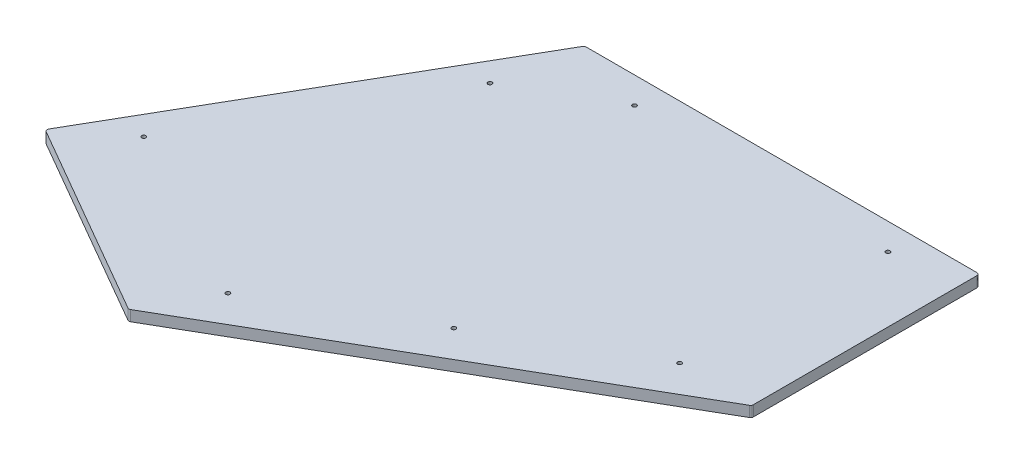
ISO-10303-21;
HEADER;
FILE_DESCRIPTION(('STEP AP214'),'2;1');
FILE_NAME('part.step','',(''),(''),'','','');
FILE_SCHEMA(('AUTOMOTIVE_DESIGN { 1 0 10303 214 1 1 1 1 }'));
ENDSEC;
DATA;
#1=APPLICATION_CONTEXT('core data for automotive mechanical design processes');
#2=APPLICATION_PROTOCOL_DEFINITION('international standard','automotive_design',2000,#1);
#3=PRODUCT_CONTEXT('',#1,'mechanical');
#4=PRODUCT('Part','Part','',(#3));
#5=PRODUCT_RELATED_PRODUCT_CATEGORY('part','',(#4));
#6=PRODUCT_DEFINITION_FORMATION('','',#4);
#7=PRODUCT_DEFINITION_CONTEXT('part definition',#1,'design');
#8=PRODUCT_DEFINITION('design','',#6,#7);
#9=PRODUCT_DEFINITION_SHAPE('','',#8);
#10=(LENGTH_UNIT() NAMED_UNIT(*) SI_UNIT(.MILLI.,.METRE.));
#11=(NAMED_UNIT(*) PLANE_ANGLE_UNIT() SI_UNIT($,.RADIAN.));
#12=(NAMED_UNIT(*) SI_UNIT($,.STERADIAN.) SOLID_ANGLE_UNIT());
#13=UNCERTAINTY_MEASURE_WITH_UNIT(LENGTH_MEASURE(1.E-05),#10,'distance_accuracy_value','');
#14=(GEOMETRIC_REPRESENTATION_CONTEXT(3) GLOBAL_UNCERTAINTY_ASSIGNED_CONTEXT((#13)) GLOBAL_UNIT_ASSIGNED_CONTEXT((#10,
#11,#12)) REPRESENTATION_CONTEXT('',''));
#15=CARTESIAN_POINT('',(0.,0.,0.));
#16=DIRECTION('',(0.,0.,1.));
#17=DIRECTION('',(1.,0.,0.));
#18=AXIS2_PLACEMENT_3D('',#15,#16,#17);
#19=CARTESIAN_POINT('',(0.,12.7,0.));
#20=DIRECTION('',(0.,1.,0.));
#21=DIRECTION('',(0.,0.,1.));
#22=AXIS2_PLACEMENT_3D('',#19,#20,#21);
#23=PLANE('',#22);
#24=CARTESIAN_POINT('',(213.713214706211,12.7,370.159699048508));
#25=DIRECTION('',(0.,1.,0.));
#26=DIRECTION('',(0.,0.,1.));
#27=AXIS2_PLACEMENT_3D('',#24,#25,#26);
#28=CIRCLE('',#27,2.45745000000002);
#29=CARTESIAN_POINT('',(213.713214706211,12.7,372.617149048508));
#30=VERTEX_POINT('',#29);
#31=EDGE_CURVE('E241',#30,#30,#28,.T.);
#32=ORIENTED_EDGE('',*,*,#31,.F.);
#33=EDGE_LOOP('',(#32));
#34=FACE_BOUND('',#33,.T.);
#35=CARTESIAN_POINT('',(394.287600704311,12.7,31.7496055682207));
#36=DIRECTION('',(0.,1.,0.));
#37=DIRECTION('',(0.,0.,1.));
#38=AXIS2_PLACEMENT_3D('',#35,#36,#37);
#39=CIRCLE('',#38,2.45744999999996);
#40=CARTESIAN_POINT('',(394.287600704311,12.7,34.2070555682207));
#41=VERTEX_POINT('',#40);
#42=EDGE_CURVE('E229',#41,#41,#39,.T.);
#43=ORIENTED_EDGE('',*,*,#42,.F.);
#44=EDGE_LOOP('',(#43));
#45=FACE_BOUND('',#44,.T.);
#46=CARTESIAN_POINT('',(-18.1641461086996,12.7,94.9617772273125));
#47=DIRECTION('',(0.,1.,0.));
#48=DIRECTION('',(0.,0.,1.));
#49=AXIS2_PLACEMENT_3D('',#46,#47,#48);
#50=CIRCLE('',#49,2.45744999999995);
#51=CARTESIAN_POINT('',(-18.1641461086996,12.7,97.4192272273125));
#52=VERTEX_POINT('',#51);
#53=EDGE_CURVE('E218',#52,#52,#50,.T.);
#54=ORIENTED_EDGE('',*,*,#53,.F.);
#55=EDGE_LOOP('',(#54));
#56=FACE_BOUND('',#55,.T.);
#57=DIRECTION('',(0.866023972491497,0.,-0.5000024790639));
#58=VECTOR('',#57,1.);
#59=CARTESIAN_POINT('',(-0.199185023168236,12.7,544.989420830469));
#60=LINE('',#59,#58);
#61=CARTESIAN_POINT('',(1.38831204742367,12.7,544.072872910301));
#62=VERTEX_POINT('',#61);
#63=CARTESIAN_POINT('',(470.487608575339,12.7,273.23647733536));
#64=VERTEX_POINT('',#63);
#65=EDGE_CURVE('E151',#62,#64,#60,.T.);
#66=ORIENTED_EDGE('',*,*,#65,.T.);
#67=CARTESIAN_POINT('',(468.900100704311,12.7,270.486851222699));
#68=DIRECTION('',(0.,1.,0.));
#69=DIRECTION('',(0.,0.,1.));
#70=AXIS2_PLACEMENT_3D('',#67,#68,#69);
#71=CIRCLE('',#70,3.175);
#72=CARTESIAN_POINT('',(472.075100704311,12.7,270.486851222699));
#73=VERTEX_POINT('',#72);
#74=EDGE_CURVE('E168',#64,#73,#71,.T.);
#75=ORIENTED_EDGE('',*,*,#74,.T.);
#76=DIRECTION('',(0.,0.,-1.));
#77=VECTOR('',#76,1.);
#78=CARTESIAN_POINT('',(472.075100704311,12.7,89.69375));
#79=LINE('',#78,#77);
#80=CARTESIAN_POINT('',(472.075100704311,12.7,3.175));
#81=VERTEX_POINT('',#80);
#82=EDGE_CURVE('E135',#73,#81,#79,.T.);
#83=ORIENTED_EDGE('',*,*,#82,.T.);
#84=CARTESIAN_POINT('',(468.900100704311,12.7,3.175));
#85=DIRECTION('',(0.,1.,0.));
#86=DIRECTION('',(0.,0.,1.));
#87=AXIS2_PLACEMENT_3D('',#84,#85,#86);
#88=CIRCLE('',#87,3.175);
#89=CARTESIAN_POINT('',(468.900100704311,12.7,0.));
#90=VERTEX_POINT('',#89);
#91=EDGE_CURVE('E162',#81,#90,#88,.T.);
#92=ORIENTED_EDGE('',*,*,#91,.T.);
#93=DIRECTION('',(-1.,0.,0.));
#94=VECTOR('',#93,1.);
#95=CARTESIAN_POINT('',(472.075100704311,12.7,0.));
#96=LINE('',#95,#94);
#97=CARTESIAN_POINT('',(1.83309351682742,12.7,0.));
#98=VERTEX_POINT('',#97);
#99=EDGE_CURVE('E145',#90,#98,#96,.T.);
#100=ORIENTED_EDGE('',*,*,#99,.T.);
#101=CARTESIAN_POINT('',(1.83309351682742,12.7,3.175));
#102=DIRECTION('',(0.,1.,0.));
#103=DIRECTION('',(0.,0.,1.));
#104=AXIS2_PLACEMENT_3D('',#101,#102,#103);
#105=CIRCLE('',#104,3.175);
#106=CARTESIAN_POINT('',(-0.916541949284118,12.7,1.58750832962766));
#107=VERTEX_POINT('',#106);
#108=EDGE_CURVE('E164',#98,#107,#105,.T.);
#109=ORIENTED_EDGE('',*,*,#108,.T.);
#110=DIRECTION('',(-0.499997376495225,0.,0.866026918460328));
#111=VECTOR('',#110,1.);
#112=CARTESIAN_POINT('',(0.,12.7,0.));
#113=LINE('',#112,#111);
#114=CARTESIAN_POINT('',(-234.448820190503,12.7,406.080109278692));
#115=VERTEX_POINT('',#114);
#116=EDGE_CURVE('E213',#107,#115,#113,.T.);
#117=ORIENTED_EDGE('',*,*,#116,.T.);
#118=CARTESIAN_POINT('',(-231.699184724391,12.7,407.667600949065));
#119=DIRECTION('',(0.,1.,0.));
#120=DIRECTION('',(0.,0.,1.));
#121=AXIS2_PLACEMENT_3D('',#118,#119,#120);
#122=CIRCLE('',#121,3.175);
#123=CARTESIAN_POINT('',(-233.286676394763,12.7,410.417236415176));
#124=VERTEX_POINT('',#123);
#125=EDGE_CURVE('E59',#115,#124,#122,.T.);
#126=ORIENTED_EDGE('',*,*,#125,.T.);
#127=DIRECTION('',(0.866026918460328,0.,0.499997376495225));
#128=VECTOR('',#127,1.);
#129=CARTESIAN_POINT('',(-236.036311860875,12.7,408.829744744804));
#130=LINE('',#129,#128);
#131=CARTESIAN_POINT('',(-1.78668749397667,12.7,544.072882263752));
#132=VERTEX_POINT('',#131);
#133=EDGE_CURVE('E210',#124,#132,#130,.T.);
#134=ORIENTED_EDGE('',*,*,#133,.T.);
#135=CARTESIAN_POINT('',(-0.199195823604249,12.7,541.323246797641));
#136=DIRECTION('',(0.,1.,0.));
#137=DIRECTION('',(0.,0.,1.));
#138=AXIS2_PLACEMENT_3D('',#135,#136,#137);
#139=CIRCLE('',#138,3.175);
#140=EDGE_CURVE('E166',#132,#62,#139,.T.);
#141=ORIENTED_EDGE('',*,*,#140,.T.);
#142=EDGE_LOOP('',(#66,#75,#83,#92,#100,#109,#117,#126,#134,#141));
#143=FACE_BOUND('',#142,.T.);
#144=CARTESIAN_POINT('',(-169.646411275637,12.7,357.338592528794));
#145=DIRECTION('',(0.,1.,0.));
#146=DIRECTION('',(0.,0.,1.));
#147=AXIS2_PLACEMENT_3D('',#144,#145,#146);
#148=CIRCLE('',#147,2.45744999999998);
#149=CARTESIAN_POINT('',(-169.646411275637,12.7,359.796042528794));
#150=VERTEX_POINT('',#149);
#151=EDGE_CURVE('E191',#150,#150,#148,.T.);
#152=ORIENTED_EDGE('',*,*,#151,.F.);
#153=EDGE_LOOP('',(#152));
#154=FACE_BOUND('',#153,.T.);
#155=CARTESIAN_POINT('',(91.3214807043114,12.7,31.7496055682207));
#156=DIRECTION('',(0.,1.,0.));
#157=DIRECTION('',(0.,0.,1.));
#158=AXIS2_PLACEMENT_3D('',#155,#156,#157);
#159=CIRCLE('',#158,2.45744999999997);
#160=CARTESIAN_POINT('',(91.3214807043114,12.7,34.2070555682207));
#161=VERTEX_POINT('',#160);
#162=EDGE_CURVE('E223',#161,#161,#159,.T.);
#163=ORIENTED_EDGE('',*,*,#162,.F.);
#164=EDGE_LOOP('',(#163));
#165=FACE_BOUND('',#164,.T.);
#166=CARTESIAN_POINT('',(384.876900704311,12.7,271.337645568221));
#167=DIRECTION('',(0.,1.,0.));
#168=DIRECTION('',(0.,0.,1.));
#169=AXIS2_PLACEMENT_3D('',#166,#167,#168);
#170=CIRCLE('',#169,2.45745000000002);
#171=CARTESIAN_POINT('',(384.876900704311,12.7,273.795095568221));
#172=VERTEX_POINT('',#171);
#173=EDGE_CURVE('E235',#172,#172,#170,.T.);
#174=ORIENTED_EDGE('',*,*,#173,.F.);
#175=EDGE_LOOP('',(#174));
#176=FACE_BOUND('',#175,.T.);
#177=CARTESIAN_POINT('',(42.5495287081099,12.7,468.981752528795));
#178=DIRECTION('',(0.,1.,0.));
#179=DIRECTION('',(0.,0.,1.));
#180=AXIS2_PLACEMENT_3D('',#177,#178,#179);
#181=CIRCLE('',#180,2.45745000000007);
#182=CARTESIAN_POINT('',(42.5495287081099,12.7,471.439202528795));
#183=VERTEX_POINT('',#182);
#184=EDGE_CURVE('E247',#183,#183,#181,.T.);
#185=ORIENTED_EDGE('',*,*,#184,.F.);
#186=EDGE_LOOP('',(#185));
#187=FACE_BOUND('',#186,.T.);
#188=ADVANCED_FACE('F37',(#34,#45,#56,#143,#154,#165,#176,#187),#23,.T.);
#189=CARTESIAN_POINT('',(0.,0.,0.));
#190=DIRECTION('',(0.,1.,0.));
#191=DIRECTION('',(0.,0.,1.));
#192=AXIS2_PLACEMENT_3D('',#189,#190,#191);
#193=PLANE('',#192);
#194=DIRECTION('',(0.,0.,-1.));
#195=VECTOR('',#194,1.);
#196=CARTESIAN_POINT('',(472.075100704311,0.,89.69375));
#197=LINE('',#196,#195);
#198=CARTESIAN_POINT('',(472.075100704311,0.,270.486851222699));
#199=VERTEX_POINT('',#198);
#200=CARTESIAN_POINT('',(472.075100704311,0.,3.17500000000003));
#201=VERTEX_POINT('',#200);
#202=EDGE_CURVE('E132',#199,#201,#197,.T.);
#203=ORIENTED_EDGE('',*,*,#202,.F.);
#204=CARTESIAN_POINT('',(468.900100704311,0.,270.486851222699));
#205=DIRECTION('',(0.,1.,0.));
#206=DIRECTION('',(0.,0.,1.));
#207=AXIS2_PLACEMENT_3D('',#204,#205,#206);
#208=CIRCLE('',#207,3.175);
#209=CARTESIAN_POINT('',(470.487608575339,0.,273.23647733536));
#210=VERTEX_POINT('',#209);
#211=EDGE_CURVE('E115',#199,#210,#208,.F.);
#212=ORIENTED_EDGE('',*,*,#211,.T.);
#213=DIRECTION('',(0.866023972491497,0.,-0.5000024790639));
#214=VECTOR('',#213,1.);
#215=CARTESIAN_POINT('',(-0.199185023168236,0.,544.989420830469));
#216=LINE('',#215,#214);
#217=CARTESIAN_POINT('',(1.38831204742367,0.,544.072872910301));
#218=VERTEX_POINT('',#217);
#219=EDGE_CURVE('E143',#218,#210,#216,.T.);
#220=ORIENTED_EDGE('',*,*,#219,.F.);
#221=CARTESIAN_POINT('',(-0.199195823604249,0.,541.323246797641));
#222=DIRECTION('',(0.,1.,0.));
#223=DIRECTION('',(0.,0.,1.));
#224=AXIS2_PLACEMENT_3D('',#221,#222,#223);
#225=CIRCLE('',#224,3.175);
#226=CARTESIAN_POINT('',(-1.78668749397663,0.,544.072882263752));
#227=VERTEX_POINT('',#226);
#228=EDGE_CURVE('E126',#218,#227,#225,.F.);
#229=ORIENTED_EDGE('',*,*,#228,.T.);
#230=DIRECTION('',(0.866026918460328,0.,0.499997376495225));
#231=VECTOR('',#230,1.);
#232=CARTESIAN_POINT('',(-71.0581838941823,0.,504.079244967144));
#233=LINE('',#232,#231);
#234=CARTESIAN_POINT('',(-233.286676394763,0.,410.417236415176));
#235=VERTEX_POINT('',#234);
#236=EDGE_CURVE('E147',#235,#227,#233,.T.);
#237=ORIENTED_EDGE('',*,*,#236,.F.);
#238=CARTESIAN_POINT('',(-231.699184724391,0.,407.667600949065));
#239=DIRECTION('',(0.,1.,0.));
#240=DIRECTION('',(0.,0.,1.));
#241=AXIS2_PLACEMENT_3D('',#238,#239,#240);
#242=CIRCLE('',#241,3.175);
#243=CARTESIAN_POINT('',(-234.448820190503,0.,406.080109278692));
#244=VERTEX_POINT('',#243);
#245=EDGE_CURVE('E136',#235,#244,#242,.F.);
#246=ORIENTED_EDGE('',*,*,#245,.T.);
#247=DIRECTION('',(-0.499997376495225,0.,0.866026918460328));
#248=VECTOR('',#247,1.);
#249=CARTESIAN_POINT('',(0.,0.,0.));
#250=LINE('',#249,#248);
#251=CARTESIAN_POINT('',(-0.916541949284118,0.,1.58750832962766));
#252=VERTEX_POINT('',#251);
#253=EDGE_CURVE('E190',#252,#244,#250,.T.);
#254=ORIENTED_EDGE('',*,*,#253,.F.);
#255=CARTESIAN_POINT('',(1.83309351682742,0.,3.175));
#256=DIRECTION('',(0.,1.,0.));
#257=DIRECTION('',(0.,0.,1.));
#258=AXIS2_PLACEMENT_3D('',#255,#256,#257);
#259=CIRCLE('',#258,3.175);
#260=CARTESIAN_POINT('',(1.83309351682742,0.,0.));
#261=VERTEX_POINT('',#260);
#262=EDGE_CURVE('E155',#252,#261,#259,.F.);
#263=ORIENTED_EDGE('',*,*,#262,.T.);
#264=DIRECTION('',(-1.,0.,0.));
#265=VECTOR('',#264,1.);
#266=CARTESIAN_POINT('',(472.075100704311,0.,0.));
#267=LINE('',#266,#265);
#268=CARTESIAN_POINT('',(468.900100704311,0.,0.));
#269=VERTEX_POINT('',#268);
#270=EDGE_CURVE('E184',#269,#261,#267,.T.);
#271=ORIENTED_EDGE('',*,*,#270,.F.);
#272=CARTESIAN_POINT('',(468.900100704311,0.,3.175));
#273=DIRECTION('',(0.,1.,0.));
#274=DIRECTION('',(0.,0.,1.));
#275=AXIS2_PLACEMENT_3D('',#272,#273,#274);
#276=CIRCLE('',#275,3.175);
#277=EDGE_CURVE('E142',#269,#201,#276,.F.);
#278=ORIENTED_EDGE('',*,*,#277,.T.);
#279=EDGE_LOOP('',(#203,#212,#220,#229,#237,#246,#254,#263,#271,#278));
#280=FACE_BOUND('',#279,.T.);
#281=CARTESIAN_POINT('',(-169.646411275637,0.,357.338592528794));
#282=DIRECTION('',(0.,1.,0.));
#283=DIRECTION('',(0.,0.,1.));
#284=AXIS2_PLACEMENT_3D('',#281,#282,#283);
#285=CIRCLE('',#284,2.45744999999998);
#286=CARTESIAN_POINT('',(-169.646411275637,0.,359.796042528794));
#287=VERTEX_POINT('',#286);
#288=EDGE_CURVE('E196',#287,#287,#285,.T.);
#289=ORIENTED_EDGE('',*,*,#288,.T.);
#290=EDGE_LOOP('',(#289));
#291=FACE_BOUND('',#290,.T.);
#292=CARTESIAN_POINT('',(-18.1641461086996,0.,94.9617772273125));
#293=DIRECTION('',(0.,1.,0.));
#294=DIRECTION('',(0.,0.,1.));
#295=AXIS2_PLACEMENT_3D('',#292,#293,#294);
#296=CIRCLE('',#295,2.45744999999995);
#297=CARTESIAN_POINT('',(-18.1641461086996,0.,97.4192272273125));
#298=VERTEX_POINT('',#297);
#299=EDGE_CURVE('E220',#298,#298,#296,.T.);
#300=ORIENTED_EDGE('',*,*,#299,.T.);
#301=EDGE_LOOP('',(#300));
#302=FACE_BOUND('',#301,.T.);
#303=CARTESIAN_POINT('',(91.3214807043114,0.,31.7496055682207));
#304=DIRECTION('',(0.,1.,0.));
#305=DIRECTION('',(0.,0.,1.));
#306=AXIS2_PLACEMENT_3D('',#303,#304,#305);
#307=CIRCLE('',#306,2.45744999999997);
#308=CARTESIAN_POINT('',(91.3214807043114,0.,34.2070555682207));
#309=VERTEX_POINT('',#308);
#310=EDGE_CURVE('E226',#309,#309,#307,.T.);
#311=ORIENTED_EDGE('',*,*,#310,.T.);
#312=EDGE_LOOP('',(#311));
#313=FACE_BOUND('',#312,.T.);
#314=CARTESIAN_POINT('',(394.287600704311,0.,31.7496055682207));
#315=DIRECTION('',(0.,1.,0.));
#316=DIRECTION('',(0.,0.,1.));
#317=AXIS2_PLACEMENT_3D('',#314,#315,#316);
#318=CIRCLE('',#317,2.45744999999996);
#319=CARTESIAN_POINT('',(394.287600704311,0.,34.2070555682207));
#320=VERTEX_POINT('',#319);
#321=EDGE_CURVE('E232',#320,#320,#318,.T.);
#322=ORIENTED_EDGE('',*,*,#321,.T.);
#323=EDGE_LOOP('',(#322));
#324=FACE_BOUND('',#323,.T.);
#325=CARTESIAN_POINT('',(384.876900704311,0.,271.337645568221));
#326=DIRECTION('',(0.,1.,0.));
#327=DIRECTION('',(0.,0.,1.));
#328=AXIS2_PLACEMENT_3D('',#325,#326,#327);
#329=CIRCLE('',#328,2.45745000000002);
#330=CARTESIAN_POINT('',(384.876900704311,0.,273.795095568221));
#331=VERTEX_POINT('',#330);
#332=EDGE_CURVE('E238',#331,#331,#329,.T.);
#333=ORIENTED_EDGE('',*,*,#332,.T.);
#334=EDGE_LOOP('',(#333));
#335=FACE_BOUND('',#334,.T.);
#336=CARTESIAN_POINT('',(213.713214706211,0.,370.159699048508));
#337=DIRECTION('',(0.,1.,0.));
#338=DIRECTION('',(0.,0.,1.));
#339=AXIS2_PLACEMENT_3D('',#336,#337,#338);
#340=CIRCLE('',#339,2.45745000000002);
#341=CARTESIAN_POINT('',(213.713214706211,0.,372.617149048508));
#342=VERTEX_POINT('',#341);
#343=EDGE_CURVE('E244',#342,#342,#340,.T.);
#344=ORIENTED_EDGE('',*,*,#343,.T.);
#345=EDGE_LOOP('',(#344));
#346=FACE_BOUND('',#345,.T.);
#347=CARTESIAN_POINT('',(42.5495287081099,0.,468.981752528795));
#348=DIRECTION('',(0.,1.,0.));
#349=DIRECTION('',(0.,0.,1.));
#350=AXIS2_PLACEMENT_3D('',#347,#348,#349);
#351=CIRCLE('',#350,2.45745000000007);
#352=CARTESIAN_POINT('',(42.5495287081099,0.,471.439202528795));
#353=VERTEX_POINT('',#352);
#354=EDGE_CURVE('E250',#353,#353,#351,.T.);
#355=ORIENTED_EDGE('',*,*,#354,.T.);
#356=EDGE_LOOP('',(#355));
#357=FACE_BOUND('',#356,.T.);
#358=ADVANCED_FACE('F139',(#280,#291,#302,#313,#324,#335,#346,#357),#193,.F.);
#359=CARTESIAN_POINT('',(472.075100704311,12.7,0.));
#360=DIRECTION('',(0.,0.,1.));
#361=DIRECTION('',(1.,0.,0.));
#362=AXIS2_PLACEMENT_3D('',#359,#360,#361);
#363=PLANE('',#362);
#364=ORIENTED_EDGE('',*,*,#270,.T.);
#365=DIRECTION('',(0.,-1.,0.));
#366=VECTOR('',#365,1.);
#367=CARTESIAN_POINT('',(1.83309351682742,12.7,0.));
#368=LINE('',#367,#366);
#369=EDGE_CURVE('E11',#261,#98,#368,.F.);
#370=ORIENTED_EDGE('',*,*,#369,.T.);
#371=ORIENTED_EDGE('',*,*,#99,.F.);
#372=DIRECTION('',(0.,-1.,0.));
#373=VECTOR('',#372,1.);
#374=CARTESIAN_POINT('',(468.900100704311,12.7,0.));
#375=LINE('',#374,#373);
#376=EDGE_CURVE('E45',#90,#269,#375,.T.);
#377=ORIENTED_EDGE('',*,*,#376,.T.);
#378=EDGE_LOOP('',(#364,#370,#371,#377));
#379=FACE_BOUND('',#378,.T.);
#380=ADVANCED_FACE('F183',(#379),#363,.F.);
#381=CARTESIAN_POINT('',(0.,12.7,0.));
#382=DIRECTION('',(0.866026918460328,0.,0.499997376495225));
#383=DIRECTION('',(0.499997376495225,0.,-0.866026918460328));
#384=AXIS2_PLACEMENT_3D('',#381,#382,#383);
#385=PLANE('',#384);
#386=ORIENTED_EDGE('',*,*,#116,.F.);
#387=DIRECTION('',(0.,-1.,0.));
#388=VECTOR('',#387,1.);
#389=CARTESIAN_POINT('',(-0.916541949284118,12.7,1.58750832962766));
#390=LINE('',#389,#388);
#391=EDGE_CURVE('E176',#107,#252,#390,.T.);
#392=ORIENTED_EDGE('',*,*,#391,.T.);
#393=ORIENTED_EDGE('',*,*,#253,.T.);
#394=DIRECTION('',(0.,-1.,0.));
#395=VECTOR('',#394,1.);
#396=CARTESIAN_POINT('',(-234.448820190503,12.7,406.080109278692));
#397=LINE('',#396,#395);
#398=EDGE_CURVE('E174',#244,#115,#397,.F.);
#399=ORIENTED_EDGE('',*,*,#398,.T.);
#400=EDGE_LOOP('',(#386,#392,#393,#399));
#401=FACE_BOUND('',#400,.T.);
#402=ADVANCED_FACE('F279',(#401),#385,.F.);
#403=CARTESIAN_POINT('',(-71.0581838941823,12.7,504.079244967144));
#404=DIRECTION('',(0.499997376495225,0.,-0.866026918460328));
#405=DIRECTION('',(-0.866026918460328,0.,-0.499997376495225));
#406=AXIS2_PLACEMENT_3D('',#403,#404,#405);
#407=PLANE('',#406);
#408=ORIENTED_EDGE('',*,*,#236,.T.);
#409=DIRECTION('',(0.,-1.,0.));
#410=VECTOR('',#409,1.);
#411=CARTESIAN_POINT('',(-1.7866874939766,12.7,544.072882263752));
#412=LINE('',#411,#410);
#413=EDGE_CURVE('E52',#227,#132,#412,.F.);
#414=ORIENTED_EDGE('',*,*,#413,.T.);
#415=ORIENTED_EDGE('',*,*,#133,.F.);
#416=DIRECTION('',(0.,-1.,0.));
#417=VECTOR('',#416,1.);
#418=CARTESIAN_POINT('',(-233.286676394763,12.7,410.417236415176));
#419=LINE('',#418,#417);
#420=EDGE_CURVE('E170',#124,#235,#419,.T.);
#421=ORIENTED_EDGE('',*,*,#420,.T.);
#422=EDGE_LOOP('',(#408,#414,#415,#421));
#423=FACE_BOUND('',#422,.T.);
#424=ADVANCED_FACE('F201',(#423),#407,.F.);
#425=CARTESIAN_POINT('',(-0.199185023168236,12.7,544.989420830469));
#426=DIRECTION('',(-0.5000024790639,0.,-0.866023972491497));
#427=DIRECTION('',(-0.866023972491498,0.,0.5000024790639));
#428=AXIS2_PLACEMENT_3D('',#425,#426,#427);
#429=PLANE('',#428);
#430=ORIENTED_EDGE('',*,*,#219,.T.);
#431=DIRECTION('',(0.,-1.,0.));
#432=VECTOR('',#431,1.);
#433=CARTESIAN_POINT('',(470.487608575339,12.7,273.23647733536));
#434=LINE('',#433,#432);
#435=EDGE_CURVE('E120',#210,#64,#434,.F.);
#436=ORIENTED_EDGE('',*,*,#435,.T.);
#437=ORIENTED_EDGE('',*,*,#65,.F.);
#438=DIRECTION('',(0.,-1.,0.));
#439=VECTOR('',#438,1.);
#440=CARTESIAN_POINT('',(1.38831204742366,12.7,544.072872910301));
#441=LINE('',#440,#439);
#442=EDGE_CURVE('E125',#62,#218,#441,.T.);
#443=ORIENTED_EDGE('',*,*,#442,.T.);
#444=EDGE_LOOP('',(#430,#436,#437,#443));
#445=FACE_BOUND('',#444,.T.);
#446=ADVANCED_FACE('F212',(#445),#429,.F.);
#447=CARTESIAN_POINT('',(472.075100704311,12.7,89.69375));
#448=DIRECTION('',(-1.,0.,0.));
#449=DIRECTION('',(0.,0.,1.));
#450=AXIS2_PLACEMENT_3D('',#447,#448,#449);
#451=PLANE('',#450);
#452=ORIENTED_EDGE('',*,*,#82,.F.);
#453=DIRECTION('',(0.,-1.,0.));
#454=VECTOR('',#453,1.);
#455=CARTESIAN_POINT('',(472.075100704311,12.7,270.486851222699));
#456=LINE('',#455,#454);
#457=EDGE_CURVE('E119',#73,#199,#456,.T.);
#458=ORIENTED_EDGE('',*,*,#457,.T.);
#459=ORIENTED_EDGE('',*,*,#202,.T.);
#460=DIRECTION('',(0.,-1.,0.));
#461=VECTOR('',#460,1.);
#462=CARTESIAN_POINT('',(472.075100704311,12.7,3.175));
#463=LINE('',#462,#461);
#464=EDGE_CURVE('E137',#201,#81,#463,.F.);
#465=ORIENTED_EDGE('',*,*,#464,.T.);
#466=EDGE_LOOP('',(#452,#458,#459,#465));
#467=FACE_BOUND('',#466,.T.);
#468=ADVANCED_FACE('F131',(#467),#451,.F.);
#469=CARTESIAN_POINT('',(-169.646411275637,12.7,357.338592528794));
#470=DIRECTION('',(0.,-1.,0.));
#471=DIRECTION('',(0.,0.,-1.));
#472=AXIS2_PLACEMENT_3D('',#469,#470,#471);
#473=CYLINDRICAL_SURFACE('',#472,2.45744999999998);
#474=ORIENTED_EDGE('',*,*,#151,.T.);
#475=EDGE_LOOP('',(#474));
#476=FACE_BOUND('',#475,.T.);
#477=ORIENTED_EDGE('',*,*,#288,.F.);
#478=EDGE_LOOP('',(#477));
#479=FACE_BOUND('',#478,.T.);
#480=ADVANCED_FACE('F270',(#476,#479),#473,.F.);
#481=CARTESIAN_POINT('',(-18.1641461086996,12.7,94.9617772273125));
#482=DIRECTION('',(0.,-1.,0.));
#483=DIRECTION('',(0.,0.,-1.));
#484=AXIS2_PLACEMENT_3D('',#481,#482,#483);
#485=CYLINDRICAL_SURFACE('',#484,2.45744999999995);
#486=ORIENTED_EDGE('',*,*,#53,.T.);
#487=EDGE_LOOP('',(#486));
#488=FACE_BOUND('',#487,.T.);
#489=ORIENTED_EDGE('',*,*,#299,.F.);
#490=EDGE_LOOP('',(#489));
#491=FACE_BOUND('',#490,.T.);
#492=ADVANCED_FACE('F355',(#488,#491),#485,.F.);
#493=CARTESIAN_POINT('',(91.3214807043114,12.7,31.7496055682207));
#494=DIRECTION('',(0.,-1.,0.));
#495=DIRECTION('',(0.,0.,-1.));
#496=AXIS2_PLACEMENT_3D('',#493,#494,#495);
#497=CYLINDRICAL_SURFACE('',#496,2.45744999999997);
#498=ORIENTED_EDGE('',*,*,#162,.T.);
#499=EDGE_LOOP('',(#498));
#500=FACE_BOUND('',#499,.T.);
#501=ORIENTED_EDGE('',*,*,#310,.F.);
#502=EDGE_LOOP('',(#501));
#503=FACE_BOUND('',#502,.T.);
#504=ADVANCED_FACE('F347',(#500,#503),#497,.F.);
#505=CARTESIAN_POINT('',(394.287600704311,12.7,31.7496055682207));
#506=DIRECTION('',(0.,-1.,0.));
#507=DIRECTION('',(0.,0.,-1.));
#508=AXIS2_PLACEMENT_3D('',#505,#506,#507);
#509=CYLINDRICAL_SURFACE('',#508,2.45744999999996);
#510=ORIENTED_EDGE('',*,*,#42,.T.);
#511=EDGE_LOOP('',(#510));
#512=FACE_BOUND('',#511,.T.);
#513=ORIENTED_EDGE('',*,*,#321,.F.);
#514=EDGE_LOOP('',(#513));
#515=FACE_BOUND('',#514,.T.);
#516=ADVANCED_FACE('F339',(#512,#515),#509,.F.);
#517=CARTESIAN_POINT('',(384.876900704311,12.7,271.337645568221));
#518=DIRECTION('',(0.,-1.,0.));
#519=DIRECTION('',(0.,0.,-1.));
#520=AXIS2_PLACEMENT_3D('',#517,#518,#519);
#521=CYLINDRICAL_SURFACE('',#520,2.45745000000002);
#522=ORIENTED_EDGE('',*,*,#173,.T.);
#523=EDGE_LOOP('',(#522));
#524=FACE_BOUND('',#523,.T.);
#525=ORIENTED_EDGE('',*,*,#332,.F.);
#526=EDGE_LOOP('',(#525));
#527=FACE_BOUND('',#526,.T.);
#528=ADVANCED_FACE('F331',(#524,#527),#521,.F.);
#529=CARTESIAN_POINT('',(213.713214706211,12.7,370.159699048508));
#530=DIRECTION('',(0.,-1.,0.));
#531=DIRECTION('',(0.,0.,-1.));
#532=AXIS2_PLACEMENT_3D('',#529,#530,#531);
#533=CYLINDRICAL_SURFACE('',#532,2.45745000000002);
#534=ORIENTED_EDGE('',*,*,#31,.T.);
#535=EDGE_LOOP('',(#534));
#536=FACE_BOUND('',#535,.T.);
#537=ORIENTED_EDGE('',*,*,#343,.F.);
#538=EDGE_LOOP('',(#537));
#539=FACE_BOUND('',#538,.T.);
#540=ADVANCED_FACE('F324',(#536,#539),#533,.F.);
#541=CARTESIAN_POINT('',(42.5495287081099,12.7,468.981752528795));
#542=DIRECTION('',(0.,-1.,0.));
#543=DIRECTION('',(0.,0.,-1.));
#544=AXIS2_PLACEMENT_3D('',#541,#542,#543);
#545=CYLINDRICAL_SURFACE('',#544,2.45745000000007);
#546=ORIENTED_EDGE('',*,*,#184,.T.);
#547=EDGE_LOOP('',(#546));
#548=FACE_BOUND('',#547,.T.);
#549=ORIENTED_EDGE('',*,*,#354,.F.);
#550=EDGE_LOOP('',(#549));
#551=FACE_BOUND('',#550,.T.);
#552=ADVANCED_FACE('F256',(#548,#551),#545,.F.);
#553=CARTESIAN_POINT('',(468.900100704311,12.7,270.486851222699));
#554=DIRECTION('',(0.,-1.,0.));
#555=DIRECTION('',(0.,0.,-1.));
#556=AXIS2_PLACEMENT_3D('',#553,#554,#555);
#557=CYLINDRICAL_SURFACE('',#556,3.175);
#558=ORIENTED_EDGE('',*,*,#74,.F.);
#559=ORIENTED_EDGE('',*,*,#435,.F.);
#560=ORIENTED_EDGE('',*,*,#211,.F.);
#561=ORIENTED_EDGE('',*,*,#457,.F.);
#562=EDGE_LOOP('',(#558,#559,#560,#561));
#563=FACE_BOUND('',#562,.T.);
#564=ADVANCED_FACE('F118',(#563),#557,.T.);
#565=CARTESIAN_POINT('',(-0.199195823604249,12.7,541.323246797641));
#566=DIRECTION('',(0.,-1.,0.));
#567=DIRECTION('',(0.,0.,-1.));
#568=AXIS2_PLACEMENT_3D('',#565,#566,#567);
#569=CYLINDRICAL_SURFACE('',#568,3.175);
#570=ORIENTED_EDGE('',*,*,#140,.F.);
#571=ORIENTED_EDGE('',*,*,#413,.F.);
#572=ORIENTED_EDGE('',*,*,#228,.F.);
#573=ORIENTED_EDGE('',*,*,#442,.F.);
#574=EDGE_LOOP('',(#570,#571,#572,#573));
#575=FACE_BOUND('',#574,.T.);
#576=ADVANCED_FACE('F205',(#575),#569,.T.);
#577=CARTESIAN_POINT('',(1.83309351682742,12.7,3.175));
#578=DIRECTION('',(0.,-1.,0.));
#579=DIRECTION('',(0.,0.,-1.));
#580=AXIS2_PLACEMENT_3D('',#577,#578,#579);
#581=CYLINDRICAL_SURFACE('',#580,3.175);
#582=ORIENTED_EDGE('',*,*,#108,.F.);
#583=ORIENTED_EDGE('',*,*,#369,.F.);
#584=ORIENTED_EDGE('',*,*,#262,.F.);
#585=ORIENTED_EDGE('',*,*,#391,.F.);
#586=EDGE_LOOP('',(#582,#583,#584,#585));
#587=FACE_BOUND('',#586,.T.);
#588=ADVANCED_FACE('F289',(#587),#581,.T.);
#589=CARTESIAN_POINT('',(468.900100704311,12.7,3.175));
#590=DIRECTION('',(0.,-1.,0.));
#591=DIRECTION('',(0.,0.,-1.));
#592=AXIS2_PLACEMENT_3D('',#589,#590,#591);
#593=CYLINDRICAL_SURFACE('',#592,3.175);
#594=ORIENTED_EDGE('',*,*,#91,.F.);
#595=ORIENTED_EDGE('',*,*,#464,.F.);
#596=ORIENTED_EDGE('',*,*,#277,.F.);
#597=ORIENTED_EDGE('',*,*,#376,.F.);
#598=EDGE_LOOP('',(#594,#595,#596,#597));
#599=FACE_BOUND('',#598,.T.);
#600=ADVANCED_FACE('F291',(#599),#593,.T.);
#601=CARTESIAN_POINT('',(-231.699184724391,12.7,407.667600949065));
#602=DIRECTION('',(0.,-1.,0.));
#603=DIRECTION('',(0.,0.,-1.));
#604=AXIS2_PLACEMENT_3D('',#601,#602,#603);
#605=CYLINDRICAL_SURFACE('',#604,3.175);
#606=ORIENTED_EDGE('',*,*,#125,.F.);
#607=ORIENTED_EDGE('',*,*,#398,.F.);
#608=ORIENTED_EDGE('',*,*,#245,.F.);
#609=ORIENTED_EDGE('',*,*,#420,.F.);
#610=EDGE_LOOP('',(#606,#607,#608,#609));
#611=FACE_BOUND('',#610,.T.);
#612=ADVANCED_FACE('F39',(#611),#605,.T.);
#613=CLOSED_SHELL('',(#188,#358,#380,#402,#424,#446,#468,#480,#492,#504,#516,#528,#540,#552,
#564,#576,#588,#600,#612));
#614=MANIFOLD_SOLID_BREP('B2',#613);
#615=ADVANCED_BREP_SHAPE_REPRESENTATION('',(#18,#614),#14);
#616=SHAPE_DEFINITION_REPRESENTATION(#9,#615);
ENDSEC;
END-ISO-10303-21;
